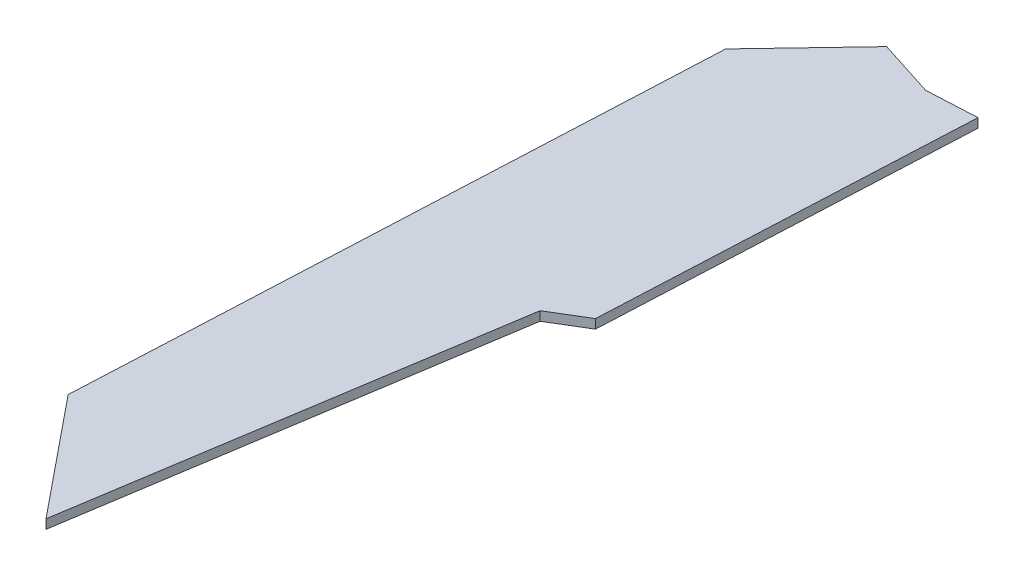
ISO-10303-21;
HEADER;
FILE_DESCRIPTION(('STEP AP214'),'2;1');
FILE_NAME('part.step','',(''),(''),'','','');
FILE_SCHEMA(('AUTOMOTIVE_DESIGN { 1 0 10303 214 1 1 1 1 }'));
ENDSEC;
DATA;
#1=APPLICATION_CONTEXT('core data for automotive mechanical design processes');
#2=APPLICATION_PROTOCOL_DEFINITION('international standard','automotive_design',2000,#1);
#3=PRODUCT_CONTEXT('',#1,'mechanical');
#4=PRODUCT('Part','Part','',(#3));
#5=PRODUCT_RELATED_PRODUCT_CATEGORY('part','',(#4));
#6=PRODUCT_DEFINITION_FORMATION('','',#4);
#7=PRODUCT_DEFINITION_CONTEXT('part definition',#1,'design');
#8=PRODUCT_DEFINITION('design','',#6,#7);
#9=PRODUCT_DEFINITION_SHAPE('','',#8);
#10=(LENGTH_UNIT() NAMED_UNIT(*) SI_UNIT(.MILLI.,.METRE.));
#11=(NAMED_UNIT(*) PLANE_ANGLE_UNIT() SI_UNIT($,.RADIAN.));
#12=(NAMED_UNIT(*) SI_UNIT($,.STERADIAN.) SOLID_ANGLE_UNIT());
#13=UNCERTAINTY_MEASURE_WITH_UNIT(LENGTH_MEASURE(1.E-05),#10,'distance_accuracy_value','');
#14=(GEOMETRIC_REPRESENTATION_CONTEXT(3) GLOBAL_UNCERTAINTY_ASSIGNED_CONTEXT((#13)) GLOBAL_UNIT_ASSIGNED_CONTEXT((#10,
#11,#12)) REPRESENTATION_CONTEXT('',''));
#15=CARTESIAN_POINT('',(0.,0.,0.));
#16=DIRECTION('',(0.,0.,1.));
#17=DIRECTION('',(1.,0.,0.));
#18=AXIS2_PLACEMENT_3D('',#15,#16,#17);
#19=CARTESIAN_POINT('',(43.1463788050466,2.,-71.8655636514127));
#20=DIRECTION('',(-0.998888293078946,0.,-0.0471399824971253));
#21=DIRECTION('',(-0.0471399824971253,0.,0.998888293078946));
#22=AXIS2_PLACEMENT_3D('',#19,#20,#21);
#23=PLANE('',#22);
#24=DIRECTION('',(0.0471399824971253,0.,-0.998888293078946));
#25=VECTOR('',#24,1.);
#26=CARTESIAN_POINT('',(43.1463788050466,0.,-71.8655636514127));
#27=LINE('',#26,#25);
#28=CARTESIAN_POINT('',(43.1463788050466,0.,-71.8655636514127));
#29=VERTEX_POINT('',#28);
#30=CARTESIAN_POINT('',(46.9057718359759,0.,-151.526469081465));
#31=VERTEX_POINT('',#30);
#32=EDGE_CURVE('E140',#29,#31,#27,.T.);
#33=ORIENTED_EDGE('',*,*,#32,.T.);
#34=DIRECTION('',(0.,-1.,0.));
#35=VECTOR('',#34,1.);
#36=CARTESIAN_POINT('',(46.9057718359759,2.,-151.526469081465));
#37=LINE('',#36,#35);
#38=CARTESIAN_POINT('',(46.9057718359759,2.,-151.526469081465));
#39=VERTEX_POINT('',#38);
#40=EDGE_CURVE('E11',#39,#31,#37,.T.);
#41=ORIENTED_EDGE('',*,*,#40,.F.);
#42=DIRECTION('',(0.0471399824971253,0.,-0.998888293078946));
#43=VECTOR('',#42,1.);
#44=CARTESIAN_POINT('',(43.1463788050466,2.,-71.8655636514127));
#45=LINE('',#44,#43);
#46=CARTESIAN_POINT('',(43.1463788050466,2.,-71.8655636514127));
#47=VERTEX_POINT('',#46);
#48=EDGE_CURVE('E162',#47,#39,#45,.T.);
#49=ORIENTED_EDGE('',*,*,#48,.F.);
#50=DIRECTION('',(0.,-1.,0.));
#51=VECTOR('',#50,1.);
#52=CARTESIAN_POINT('',(43.1463788050466,2.,-71.8655636514127));
#53=LINE('',#52,#51);
#54=EDGE_CURVE('E136',#47,#29,#53,.T.);
#55=ORIENTED_EDGE('',*,*,#54,.T.);
#56=EDGE_LOOP('',(#33,#41,#49,#55));
#57=FACE_BOUND('',#56,.T.);
#58=ADVANCED_FACE('F39',(#57),#23,.F.);
#59=CARTESIAN_POINT('',(46.9057718359759,2.,-151.526469081465));
#60=DIRECTION('',(0.0503558343226157,0.,0.998731340226026));
#61=DIRECTION('',(0.998731340226026,0.,-0.0503558343226157));
#62=AXIS2_PLACEMENT_3D('',#59,#60,#61);
#63=PLANE('',#62);
#64=DIRECTION('',(-0.998731340226026,0.,0.0503558343226157));
#65=VECTOR('',#64,1.);
#66=CARTESIAN_POINT('',(46.9057718359759,0.,-151.526469081465));
#67=LINE('',#66,#65);
#68=CARTESIAN_POINT('',(36.0380445949732,0.,-150.978520448665));
#69=VERTEX_POINT('',#68);
#70=EDGE_CURVE('E144',#31,#69,#67,.T.);
#71=ORIENTED_EDGE('',*,*,#70,.T.);
#72=DIRECTION('',(0.,-1.,0.));
#73=VECTOR('',#72,1.);
#74=CARTESIAN_POINT('',(36.0380445949732,2.,-150.978520448665));
#75=LINE('',#74,#73);
#76=CARTESIAN_POINT('',(36.0380445949732,2.,-150.978520448665));
#77=VERTEX_POINT('',#76);
#78=EDGE_CURVE('E48',#77,#69,#75,.T.);
#79=ORIENTED_EDGE('',*,*,#78,.F.);
#80=DIRECTION('',(-0.998731340226026,0.,0.0503558343226157));
#81=VECTOR('',#80,1.);
#82=CARTESIAN_POINT('',(46.9057718359759,2.,-151.526469081465));
#83=LINE('',#82,#81);
#84=EDGE_CURVE('E99',#39,#77,#83,.T.);
#85=ORIENTED_EDGE('',*,*,#84,.F.);
#86=ORIENTED_EDGE('',*,*,#40,.T.);
#87=EDGE_LOOP('',(#71,#79,#85,#86));
#88=FACE_BOUND('',#87,.T.);
#89=ADVANCED_FACE('F208',(#88),#63,.F.);
#90=CARTESIAN_POINT('',(36.0380445949732,2.,-150.978520448665));
#91=DIRECTION('',(-0.305205058632961,0.,0.952286654419167));
#92=DIRECTION('',(0.952286654419167,0.,0.305205058632961));
#93=AXIS2_PLACEMENT_3D('',#90,#91,#92);
#94=PLANE('',#93);
#95=DIRECTION('',(-0.952286654419167,0.,-0.305205058632961));
#96=VECTOR('',#95,1.);
#97=CARTESIAN_POINT('',(36.0380445949732,0.,-150.978520448665));
#98=LINE('',#97,#96);
#99=CARTESIAN_POINT('',(23.5381969738636,0.,-154.984684672851));
#100=VERTEX_POINT('',#99);
#101=EDGE_CURVE('E147',#69,#100,#98,.T.);
#102=ORIENTED_EDGE('',*,*,#101,.T.);
#103=DIRECTION('',(0.,-1.,0.));
#104=VECTOR('',#103,1.);
#105=CARTESIAN_POINT('',(23.5381969738636,2.,-154.984684672851));
#106=LINE('',#105,#104);
#107=CARTESIAN_POINT('',(23.5381969738636,2.,-154.984684672851));
#108=VERTEX_POINT('',#107);
#109=EDGE_CURVE('E173',#108,#100,#106,.T.);
#110=ORIENTED_EDGE('',*,*,#109,.F.);
#111=DIRECTION('',(-0.952286654419167,0.,-0.305205058632961));
#112=VECTOR('',#111,1.);
#113=CARTESIAN_POINT('',(36.0380445949732,2.,-150.978520448665));
#114=LINE('',#113,#112);
#115=EDGE_CURVE('E183',#77,#108,#114,.T.);
#116=ORIENTED_EDGE('',*,*,#115,.F.);
#117=ORIENTED_EDGE('',*,*,#78,.T.);
#118=EDGE_LOOP('',(#102,#110,#116,#117));
#119=FACE_BOUND('',#118,.T.);
#120=ADVANCED_FACE('F181',(#119),#94,.F.);
#121=CARTESIAN_POINT('',(23.5381969738636,2.,-154.984684672851));
#122=DIRECTION('',(0.724630719616716,0.,0.689137373959474));
#123=DIRECTION('',(0.689137373959474,0.,-0.724630719616716));
#124=AXIS2_PLACEMENT_3D('',#121,#122,#123);
#125=PLANE('',#124);
#126=DIRECTION('',(-0.689137373959474,0.,0.724630719616716));
#127=VECTOR('',#126,1.);
#128=CARTESIAN_POINT('',(23.5381969738636,0.,-154.984684672851));
#129=LINE('',#128,#127);
#130=CARTESIAN_POINT('',(6.4201620869907,0.,-136.985002160742));
#131=VERTEX_POINT('',#130);
#132=EDGE_CURVE('E150',#100,#131,#129,.T.);
#133=ORIENTED_EDGE('',*,*,#132,.T.);
#134=DIRECTION('',(0.,-1.,0.));
#135=VECTOR('',#134,1.);
#136=CARTESIAN_POINT('',(6.4201620869907,2.,-136.985002160742));
#137=LINE('',#136,#135);
#138=CARTESIAN_POINT('',(6.4201620869907,2.,-136.985002160742));
#139=VERTEX_POINT('',#138);
#140=EDGE_CURVE('E169',#139,#131,#137,.T.);
#141=ORIENTED_EDGE('',*,*,#140,.F.);
#142=DIRECTION('',(-0.689137373959474,0.,0.724630719616716));
#143=VECTOR('',#142,1.);
#144=CARTESIAN_POINT('',(23.5381969738636,2.,-154.984684672851));
#145=LINE('',#144,#143);
#146=EDGE_CURVE('E196',#108,#139,#145,.T.);
#147=ORIENTED_EDGE('',*,*,#146,.F.);
#148=ORIENTED_EDGE('',*,*,#109,.T.);
#149=EDGE_LOOP('',(#133,#141,#147,#148));
#150=FACE_BOUND('',#149,.T.);
#151=ADVANCED_FACE('F191',(#150),#125,.F.);
#152=CARTESIAN_POINT('',(6.4201620869907,2.,-136.985002160742));
#153=DIRECTION('',(0.998903518781841,0.,0.0468162382646783));
#154=DIRECTION('',(0.0468162382646783,0.,-0.998903518781842));
#155=AXIS2_PLACEMENT_3D('',#152,#153,#154);
#156=PLANE('',#155);
#157=DIRECTION('',(-0.0468162382646783,0.,0.998903518781841));
#158=VECTOR('',#157,1.);
#159=CARTESIAN_POINT('',(6.4201620869907,0.,-136.985002160742));
#160=LINE('',#159,#158);
#161=CARTESIAN_POINT('',(0.,0.,0.));
#162=VERTEX_POINT('',#161);
#163=EDGE_CURVE('E153',#131,#162,#160,.T.);
#164=ORIENTED_EDGE('',*,*,#163,.T.);
#165=DIRECTION('',(0.,-1.,0.));
#166=VECTOR('',#165,1.);
#167=CARTESIAN_POINT('',(0.,2.,0.));
#168=LINE('',#167,#166);
#169=CARTESIAN_POINT('',(0.,2.,0.));
#170=VERTEX_POINT('',#169);
#171=EDGE_CURVE('E129',#170,#162,#168,.T.);
#172=ORIENTED_EDGE('',*,*,#171,.F.);
#173=DIRECTION('',(-0.0468162382646783,0.,0.998903518781841));
#174=VECTOR('',#173,1.);
#175=CARTESIAN_POINT('',(6.4201620869907,2.,-136.985002160742));
#176=LINE('',#175,#174);
#177=EDGE_CURVE('E118',#139,#170,#176,.T.);
#178=ORIENTED_EDGE('',*,*,#177,.F.);
#179=ORIENTED_EDGE('',*,*,#140,.T.);
#180=EDGE_LOOP('',(#164,#172,#178,#179));
#181=FACE_BOUND('',#180,.T.);
#182=ADVANCED_FACE('F194',(#181),#156,.F.);
#183=CARTESIAN_POINT('',(0.,2.,0.));
#184=DIRECTION('',(0.7757602186966,0.,-0.631027798981791));
#185=DIRECTION('',(-0.631027798981791,0.,-0.7757602186966));
#186=AXIS2_PLACEMENT_3D('',#183,#184,#185);
#187=PLANE('',#186);
#188=DIRECTION('',(0.631027798981791,0.,0.7757602186966));
#189=VECTOR('',#188,1.);
#190=CARTESIAN_POINT('',(0.,0.,0.));
#191=LINE('',#190,#189);
#192=CARTESIAN_POINT('',(21.0429795606097,0.,25.8693934757028));
#193=VERTEX_POINT('',#192);
#194=EDGE_CURVE('E127',#162,#193,#191,.T.);
#195=ORIENTED_EDGE('',*,*,#194,.T.);
#196=DIRECTION('',(0.,-1.,0.));
#197=VECTOR('',#196,1.);
#198=CARTESIAN_POINT('',(21.0429795606097,2.,25.8693934757028));
#199=LINE('',#198,#197);
#200=CARTESIAN_POINT('',(21.0429795606097,2.,25.8693934757028));
#201=VERTEX_POINT('',#200);
#202=EDGE_CURVE('E124',#201,#193,#199,.T.);
#203=ORIENTED_EDGE('',*,*,#202,.F.);
#204=DIRECTION('',(0.631027798981791,0.,0.7757602186966));
#205=VECTOR('',#204,1.);
#206=CARTESIAN_POINT('',(0.,2.,0.));
#207=LINE('',#206,#205);
#208=EDGE_CURVE('E112',#170,#201,#207,.T.);
#209=ORIENTED_EDGE('',*,*,#208,.F.);
#210=ORIENTED_EDGE('',*,*,#171,.T.);
#211=EDGE_LOOP('',(#195,#203,#209,#210));
#212=FACE_BOUND('',#211,.T.);
#213=ADVANCED_FACE('F125',(#212),#187,.F.);
#214=CARTESIAN_POINT('',(21.0429795606097,2.,25.8693934757028));
#215=DIRECTION('',(-0.987990846069924,0.,-0.154512420478211));
#216=DIRECTION('',(-0.154512420478211,0.,0.987990846069924));
#217=AXIS2_PLACEMENT_3D('',#214,#215,#216);
#218=PLANE('',#217);
#219=DIRECTION('',(0.154512420478211,0.,-0.987990846069924));
#220=VECTOR('',#219,1.);
#221=CARTESIAN_POINT('',(21.0429795606097,0.,25.8693934757028));
#222=LINE('',#221,#220);
#223=CARTESIAN_POINT('',(35.6156746024217,0.,-67.3120430671881));
#224=VERTEX_POINT('',#223);
#225=EDGE_CURVE('E85',#193,#224,#222,.T.);
#226=ORIENTED_EDGE('',*,*,#225,.T.);
#227=DIRECTION('',(0.,-1.,0.));
#228=VECTOR('',#227,1.);
#229=CARTESIAN_POINT('',(35.6156746024217,2.,-67.3120430671881));
#230=LINE('',#229,#228);
#231=CARTESIAN_POINT('',(35.6156746024217,2.,-67.3120430671881));
#232=VERTEX_POINT('',#231);
#233=EDGE_CURVE('E130',#232,#224,#230,.T.);
#234=ORIENTED_EDGE('',*,*,#233,.F.);
#235=DIRECTION('',(0.154512420478211,0.,-0.987990846069924));
#236=VECTOR('',#235,1.);
#237=CARTESIAN_POINT('',(21.0429795606097,2.,25.8693934757028));
#238=LINE('',#237,#236);
#239=EDGE_CURVE('E116',#201,#232,#238,.T.);
#240=ORIENTED_EDGE('',*,*,#239,.F.);
#241=ORIENTED_EDGE('',*,*,#202,.T.);
#242=EDGE_LOOP('',(#226,#234,#240,#241));
#243=FACE_BOUND('',#242,.T.);
#244=ADVANCED_FACE('F132',(#243),#218,.F.);
#245=CARTESIAN_POINT('',(35.6156746024217,2.,-67.3120430671881));
#246=DIRECTION('',(-0.517425291035558,0.,-0.855728384592195));
#247=DIRECTION('',(-0.855728384592195,0.,0.517425291035558));
#248=AXIS2_PLACEMENT_3D('',#245,#246,#247);
#249=PLANE('',#248);
#250=DIRECTION('',(0.855728384592195,0.,-0.517425291035558));
#251=VECTOR('',#250,1.);
#252=CARTESIAN_POINT('',(35.6156746024217,0.,-67.3120430671881));
#253=LINE('',#252,#251);
#254=EDGE_CURVE('E91',#224,#29,#253,.T.);
#255=ORIENTED_EDGE('',*,*,#254,.T.);
#256=ORIENTED_EDGE('',*,*,#54,.F.);
#257=DIRECTION('',(0.855728384592195,0.,-0.517425291035558));
#258=VECTOR('',#257,1.);
#259=CARTESIAN_POINT('',(35.6156746024217,2.,-67.3120430671881));
#260=LINE('',#259,#258);
#261=EDGE_CURVE('E56',#232,#47,#260,.T.);
#262=ORIENTED_EDGE('',*,*,#261,.F.);
#263=ORIENTED_EDGE('',*,*,#233,.T.);
#264=EDGE_LOOP('',(#255,#256,#262,#263));
#265=FACE_BOUND('',#264,.T.);
#266=ADVANCED_FACE('F224',(#265),#249,.F.);
#267=CARTESIAN_POINT('',(0.,2.,0.));
#268=DIRECTION('',(0.,1.,0.));
#269=DIRECTION('',(0.,0.,1.));
#270=AXIS2_PLACEMENT_3D('',#267,#268,#269);
#271=PLANE('',#270);
#272=ORIENTED_EDGE('',*,*,#48,.T.);
#273=ORIENTED_EDGE('',*,*,#84,.T.);
#274=ORIENTED_EDGE('',*,*,#115,.T.);
#275=ORIENTED_EDGE('',*,*,#146,.T.);
#276=ORIENTED_EDGE('',*,*,#177,.T.);
#277=ORIENTED_EDGE('',*,*,#208,.T.);
#278=ORIENTED_EDGE('',*,*,#239,.T.);
#279=ORIENTED_EDGE('',*,*,#261,.T.);
#280=EDGE_LOOP('',(#272,#273,#274,#275,#276,#277,#278,#279));
#281=FACE_BOUND('',#280,.T.);
#282=ADVANCED_FACE('F114',(#281),#271,.T.);
#283=CARTESIAN_POINT('',(0.,0.,0.));
#284=DIRECTION('',(0.,1.,0.));
#285=DIRECTION('',(0.,0.,1.));
#286=AXIS2_PLACEMENT_3D('',#283,#284,#285);
#287=PLANE('',#286);
#288=ORIENTED_EDGE('',*,*,#32,.F.);
#289=ORIENTED_EDGE('',*,*,#254,.F.);
#290=ORIENTED_EDGE('',*,*,#225,.F.);
#291=ORIENTED_EDGE('',*,*,#194,.F.);
#292=ORIENTED_EDGE('',*,*,#163,.F.);
#293=ORIENTED_EDGE('',*,*,#132,.F.);
#294=ORIENTED_EDGE('',*,*,#101,.F.);
#295=ORIENTED_EDGE('',*,*,#70,.F.);
#296=EDGE_LOOP('',(#288,#289,#290,#291,#292,#293,#294,#295));
#297=FACE_BOUND('',#296,.T.);
#298=ADVANCED_FACE('F187',(#297),#287,.F.);
#299=CLOSED_SHELL('',(#58,#89,#120,#151,#182,#213,#244,#266,#282,#298));
#300=MANIFOLD_SOLID_BREP('B2',#299);
#301=ADVANCED_BREP_SHAPE_REPRESENTATION('',(#18,#300),#14);
#302=SHAPE_DEFINITION_REPRESENTATION(#9,#301);
ENDSEC;
END-ISO-10303-21;
